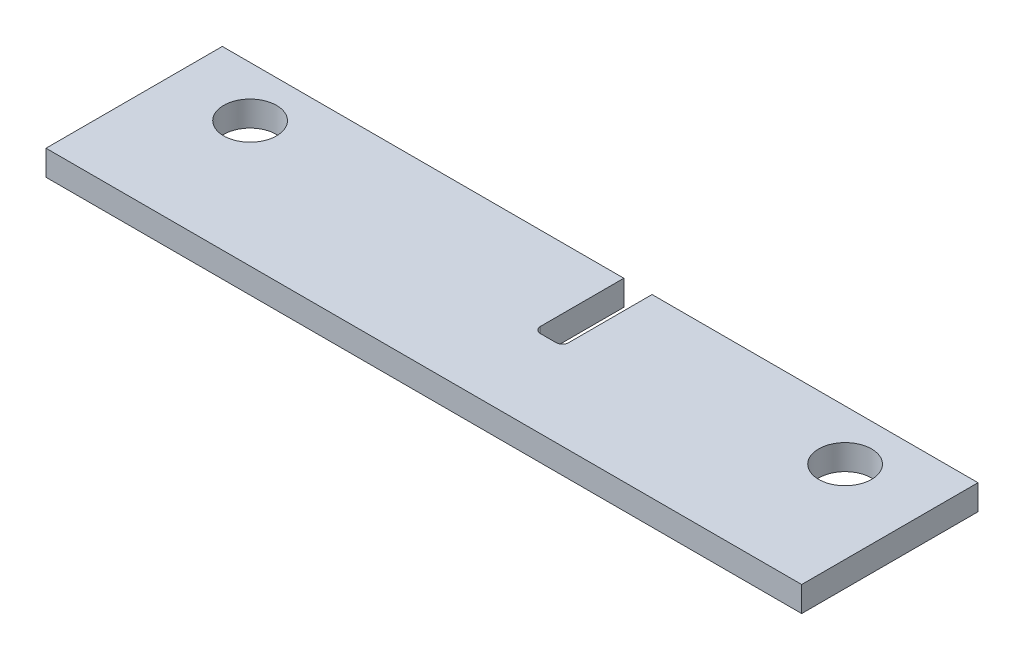
ISO-10303-21;
HEADER;
FILE_DESCRIPTION(('STEP AP214'),'2;1');
FILE_NAME('part.step','',(''),(''),'','','');
FILE_SCHEMA(('AUTOMOTIVE_DESIGN { 1 0 10303 214 1 1 1 1 }'));
ENDSEC;
DATA;
#1=APPLICATION_CONTEXT('core data for automotive mechanical design processes');
#2=APPLICATION_PROTOCOL_DEFINITION('international standard','automotive_design',2000,#1);
#3=PRODUCT_CONTEXT('',#1,'mechanical');
#4=PRODUCT('Part','Part','',(#3));
#5=PRODUCT_RELATED_PRODUCT_CATEGORY('part','',(#4));
#6=PRODUCT_DEFINITION_FORMATION('','',#4);
#7=PRODUCT_DEFINITION_CONTEXT('part definition',#1,'design');
#8=PRODUCT_DEFINITION('design','',#6,#7);
#9=PRODUCT_DEFINITION_SHAPE('','',#8);
#10=(LENGTH_UNIT() NAMED_UNIT(*) SI_UNIT(.MILLI.,.METRE.));
#11=(NAMED_UNIT(*) PLANE_ANGLE_UNIT() SI_UNIT($,.RADIAN.));
#12=(NAMED_UNIT(*) SI_UNIT($,.STERADIAN.) SOLID_ANGLE_UNIT());
#13=UNCERTAINTY_MEASURE_WITH_UNIT(LENGTH_MEASURE(1.E-05),#10,'distance_accuracy_value','');
#14=(GEOMETRIC_REPRESENTATION_CONTEXT(3) GLOBAL_UNCERTAINTY_ASSIGNED_CONTEXT((#13)) GLOBAL_UNIT_ASSIGNED_CONTEXT((#10,
#11,#12)) REPRESENTATION_CONTEXT('',''));
#15=CARTESIAN_POINT('',(0.,0.,0.));
#16=DIRECTION('',(0.,0.,1.));
#17=DIRECTION('',(1.,0.,0.));
#18=AXIS2_PLACEMENT_3D('',#15,#16,#17);
#19=CARTESIAN_POINT('',(0.,0.,249.6));
#20=DIRECTION('',(0.,0.,1.));
#21=DIRECTION('',(1.,0.,0.));
#22=AXIS2_PLACEMENT_3D('',#19,#20,#21);
#23=PLANE('',#22);
#24=DIRECTION('',(-1.,0.,0.));
#25=VECTOR('',#24,1.);
#26=CARTESIAN_POINT('',(2260.6,65.,249.6));
#27=LINE('',#26,#25);
#28=CARTESIAN_POINT('',(2463.038,65.,249.6));
#29=VERTEX_POINT('',#28);
#30=CARTESIAN_POINT('',(2260.6,65.,249.6));
#31=VERTEX_POINT('',#30);
#32=EDGE_CURVE('E119',#29,#31,#27,.T.);
#33=ORIENTED_EDGE('',*,*,#32,.F.);
#34=DIRECTION('',(0.,1.,0.));
#35=VECTOR('',#34,1.);
#36=CARTESIAN_POINT('',(2463.038,52.3,249.6));
#37=LINE('',#36,#35);
#38=CARTESIAN_POINT('',(2463.038,52.3,249.6));
#39=VERTEX_POINT('',#38);
#40=EDGE_CURVE('E186',#39,#29,#37,.T.);
#41=ORIENTED_EDGE('',*,*,#40,.F.);
#42=DIRECTION('',(1.,0.,0.));
#43=VECTOR('',#42,1.);
#44=CARTESIAN_POINT('',(2260.6,52.3,249.6));
#45=LINE('',#44,#43);
#46=CARTESIAN_POINT('',(2260.6,52.3,249.6));
#47=VERTEX_POINT('',#46);
#48=EDGE_CURVE('E144',#47,#39,#45,.T.);
#49=ORIENTED_EDGE('',*,*,#48,.F.);
#50=DIRECTION('',(0.,-1.,0.));
#51=VECTOR('',#50,1.);
#52=CARTESIAN_POINT('',(2260.6,65.,249.6));
#53=LINE('',#52,#51);
#54=EDGE_CURVE('E137',#31,#47,#53,.T.);
#55=ORIENTED_EDGE('',*,*,#54,.F.);
#56=EDGE_LOOP('',(#33,#41,#49,#55));
#57=FACE_BOUND('',#56,.T.);
#58=ADVANCED_FACE('F44',(#57),#23,.F.);
#59=CARTESIAN_POINT('',(2260.6,65.,249.6));
#60=DIRECTION('',(-1.,0.,0.));
#61=DIRECTION('',(0.,0.,1.));
#62=AXIS2_PLACEMENT_3D('',#59,#60,#61);
#63=PLANE('',#62);
#64=DIRECTION('',(0.,0.,1.));
#65=VECTOR('',#64,1.);
#66=CARTESIAN_POINT('',(2260.6,52.3,249.6));
#67=LINE('',#66,#65);
#68=CARTESIAN_POINT('',(2260.6,52.3,338.5));
#69=VERTEX_POINT('',#68);
#70=EDGE_CURVE('E147',#47,#69,#67,.T.);
#71=ORIENTED_EDGE('',*,*,#70,.T.);
#72=DIRECTION('',(0.,-1.,0.));
#73=VECTOR('',#72,1.);
#74=CARTESIAN_POINT('',(2260.6,65.,338.5));
#75=LINE('',#74,#73);
#76=CARTESIAN_POINT('',(2260.6,65.,338.5));
#77=VERTEX_POINT('',#76);
#78=EDGE_CURVE('E139',#77,#69,#75,.T.);
#79=ORIENTED_EDGE('',*,*,#78,.F.);
#80=DIRECTION('',(0.,0.,1.));
#81=VECTOR('',#80,1.);
#82=CARTESIAN_POINT('',(2260.6,65.,249.6));
#83=LINE('',#82,#81);
#84=EDGE_CURVE('E123',#31,#77,#83,.T.);
#85=ORIENTED_EDGE('',*,*,#84,.F.);
#86=ORIENTED_EDGE('',*,*,#54,.T.);
#87=EDGE_LOOP('',(#71,#79,#85,#86));
#88=FACE_BOUND('',#87,.T.);
#89=ADVANCED_FACE('F136',(#88),#63,.T.);
#90=CARTESIAN_POINT('',(2260.6,65.,249.6));
#91=DIRECTION('',(0.,1.,0.));
#92=DIRECTION('',(0.,0.,1.));
#93=AXIS2_PLACEMENT_3D('',#90,#91,#92);
#94=PLANE('',#93);
#95=CARTESIAN_POINT('',(2599.99999999996,65.,275.));
#96=DIRECTION('',(0.,1.,0.));
#97=DIRECTION('',(0.,0.,1.));
#98=AXIS2_PLACEMENT_3D('',#95,#96,#97);
#99=CIRCLE('',#98,13.3349999999999);
#100=CARTESIAN_POINT('',(2599.99999999996,64.9999999999999,261.665));
#101=VERTEX_POINT('',#100);
#102=EDGE_CURVE('E146',#101,#101,#99,.F.);
#103=ORIENTED_EDGE('',*,*,#102,.T.);
#104=EDGE_LOOP('',(#103));
#105=FACE_BOUND('',#104,.T.);
#106=CARTESIAN_POINT('',(2299.99999999996,65.,275.));
#107=DIRECTION('',(0.,1.,0.));
#108=DIRECTION('',(0.,0.,1.));
#109=AXIS2_PLACEMENT_3D('',#106,#107,#108);
#110=CIRCLE('',#109,13.3349999999999);
#111=CARTESIAN_POINT('',(2299.99999999996,65.,261.665));
#112=VERTEX_POINT('',#111);
#113=EDGE_CURVE('E130',#112,#112,#110,.F.);
#114=ORIENTED_EDGE('',*,*,#113,.T.);
#115=EDGE_LOOP('',(#114));
#116=FACE_BOUND('',#115,.T.);
#117=DIRECTION('',(0.,0.,1.));
#118=VECTOR('',#117,1.);
#119=CARTESIAN_POINT('',(2463.038,65.,249.6));
#120=LINE('',#119,#118);
#121=CARTESIAN_POINT('',(2463.038,65.,291.637));
#122=VERTEX_POINT('',#121);
#123=EDGE_CURVE('E125',#29,#122,#120,.T.);
#124=ORIENTED_EDGE('',*,*,#123,.F.);
#125=ORIENTED_EDGE('',*,*,#32,.T.);
#126=ORIENTED_EDGE('',*,*,#84,.T.);
#127=DIRECTION('',(-1.,0.,0.));
#128=VECTOR('',#127,1.);
#129=CARTESIAN_POINT('',(2260.6,65.,338.5));
#130=LINE('',#129,#128);
#131=CARTESIAN_POINT('',(2641.6,65.,338.5));
#132=VERTEX_POINT('',#131);
#133=EDGE_CURVE('E157',#132,#77,#130,.T.);
#134=ORIENTED_EDGE('',*,*,#133,.F.);
#135=DIRECTION('',(0.,0.,1.));
#136=VECTOR('',#135,1.);
#137=CARTESIAN_POINT('',(2641.6,65.,249.6));
#138=LINE('',#137,#136);
#139=CARTESIAN_POINT('',(2641.6,65.,249.6));
#140=VERTEX_POINT('',#139);
#141=EDGE_CURVE('E236',#140,#132,#138,.T.);
#142=ORIENTED_EDGE('',*,*,#141,.F.);
#143=CARTESIAN_POINT('',(2477.262,65.,249.6));
#144=VERTEX_POINT('',#143);
#145=EDGE_CURVE('E132',#140,#144,#27,.T.);
#146=ORIENTED_EDGE('',*,*,#145,.T.);
#147=DIRECTION('',(0.,0.,-1.));
#148=VECTOR('',#147,1.);
#149=CARTESIAN_POINT('',(2477.262,65.,249.6));
#150=LINE('',#149,#148);
#151=CARTESIAN_POINT('',(2477.262,65.,291.637));
#152=VERTEX_POINT('',#151);
#153=EDGE_CURVE('E189',#152,#144,#150,.T.);
#154=ORIENTED_EDGE('',*,*,#153,.F.);
#155=CARTESIAN_POINT('',(2474.087,65.,291.637));
#156=DIRECTION('',(0.,1.,0.));
#157=DIRECTION('',(0.,0.,1.));
#158=AXIS2_PLACEMENT_3D('',#155,#156,#157);
#159=CIRCLE('',#158,3.175);
#160=CARTESIAN_POINT('',(2474.087,65.,294.812));
#161=VERTEX_POINT('',#160);
#162=EDGE_CURVE('E222',#152,#161,#159,.F.);
#163=ORIENTED_EDGE('',*,*,#162,.T.);
#164=DIRECTION('',(1.,0.,0.));
#165=VECTOR('',#164,1.);
#166=CARTESIAN_POINT('',(2260.6,65.,294.812));
#167=LINE('',#166,#165);
#168=CARTESIAN_POINT('',(2466.213,65.,294.812));
#169=VERTEX_POINT('',#168);
#170=EDGE_CURVE('E205',#169,#161,#167,.T.);
#171=ORIENTED_EDGE('',*,*,#170,.F.);
#172=CARTESIAN_POINT('',(2466.213,65.,291.637));
#173=DIRECTION('',(0.,1.,0.));
#174=DIRECTION('',(0.,0.,1.));
#175=AXIS2_PLACEMENT_3D('',#172,#173,#174);
#176=CIRCLE('',#175,3.175);
#177=EDGE_CURVE('E53',#169,#122,#176,.F.);
#178=ORIENTED_EDGE('',*,*,#177,.T.);
#179=EDGE_LOOP('',(#124,#125,#126,#134,#142,#146,#154,#163,#171,#178));
#180=FACE_BOUND('',#179,.T.);
#181=ADVANCED_FACE('F121',(#105,#116,#180),#94,.T.);
#182=CARTESIAN_POINT('',(2641.6,65.,249.6));
#183=DIRECTION('',(1.,0.,0.));
#184=DIRECTION('',(0.,0.,-1.));
#185=AXIS2_PLACEMENT_3D('',#182,#183,#184);
#186=PLANE('',#185);
#187=ORIENTED_EDGE('',*,*,#141,.T.);
#188=DIRECTION('',(0.,1.,0.));
#189=VECTOR('',#188,1.);
#190=CARTESIAN_POINT('',(2641.6,65.,338.5));
#191=LINE('',#190,#189);
#192=CARTESIAN_POINT('',(2641.6,52.3,338.5));
#193=VERTEX_POINT('',#192);
#194=EDGE_CURVE('E160',#193,#132,#191,.T.);
#195=ORIENTED_EDGE('',*,*,#194,.F.);
#196=DIRECTION('',(0.,0.,1.));
#197=VECTOR('',#196,1.);
#198=CARTESIAN_POINT('',(2641.6,52.3,249.6));
#199=LINE('',#198,#197);
#200=CARTESIAN_POINT('',(2641.6,52.3,249.6));
#201=VERTEX_POINT('',#200);
#202=EDGE_CURVE('E230',#201,#193,#199,.T.);
#203=ORIENTED_EDGE('',*,*,#202,.F.);
#204=DIRECTION('',(0.,1.,0.));
#205=VECTOR('',#204,1.);
#206=CARTESIAN_POINT('',(2641.6,65.,249.6));
#207=LINE('',#206,#205);
#208=EDGE_CURVE('E176',#201,#140,#207,.T.);
#209=ORIENTED_EDGE('',*,*,#208,.T.);
#210=EDGE_LOOP('',(#187,#195,#203,#209));
#211=FACE_BOUND('',#210,.T.);
#212=ADVANCED_FACE('F287',(#211),#186,.T.);
#213=CARTESIAN_POINT('',(2260.6,52.3,249.6));
#214=DIRECTION('',(0.,-1.,0.));
#215=DIRECTION('',(0.,0.,-1.));
#216=AXIS2_PLACEMENT_3D('',#213,#214,#215);
#217=PLANE('',#216);
#218=CARTESIAN_POINT('',(2599.99999999996,52.3,275.));
#219=DIRECTION('',(0.,-1.,0.));
#220=DIRECTION('',(0.,0.,-1.));
#221=AXIS2_PLACEMENT_3D('',#218,#219,#220);
#222=CIRCLE('',#221,13.3349999999999);
#223=CARTESIAN_POINT('',(2599.99999999996,52.3,261.665));
#224=VERTEX_POINT('',#223);
#225=EDGE_CURVE('E171',#224,#224,#222,.F.);
#226=ORIENTED_EDGE('',*,*,#225,.T.);
#227=EDGE_LOOP('',(#226));
#228=FACE_BOUND('',#227,.T.);
#229=CARTESIAN_POINT('',(2299.99999999996,52.3,275.));
#230=DIRECTION('',(0.,-1.,0.));
#231=DIRECTION('',(0.,0.,-1.));
#232=AXIS2_PLACEMENT_3D('',#229,#230,#231);
#233=CIRCLE('',#232,13.3349999999999);
#234=CARTESIAN_POINT('',(2299.99999999996,52.3,261.665));
#235=VERTEX_POINT('',#234);
#236=EDGE_CURVE('E175',#235,#235,#233,.F.);
#237=ORIENTED_EDGE('',*,*,#236,.T.);
#238=EDGE_LOOP('',(#237));
#239=FACE_BOUND('',#238,.T.);
#240=DIRECTION('',(0.,0.,1.));
#241=VECTOR('',#240,1.);
#242=CARTESIAN_POINT('',(2463.038,52.3,249.6));
#243=LINE('',#242,#241);
#244=CARTESIAN_POINT('',(2463.038,52.3,291.637));
#245=VERTEX_POINT('',#244);
#246=EDGE_CURVE('E183',#39,#245,#243,.T.);
#247=ORIENTED_EDGE('',*,*,#246,.T.);
#248=CARTESIAN_POINT('',(2466.213,52.3,291.637));
#249=DIRECTION('',(0.,-1.,0.));
#250=DIRECTION('',(0.,0.,-1.));
#251=AXIS2_PLACEMENT_3D('',#248,#249,#250);
#252=CIRCLE('',#251,3.175);
#253=CARTESIAN_POINT('',(2466.213,52.3,294.812));
#254=VERTEX_POINT('',#253);
#255=EDGE_CURVE('E12',#245,#254,#252,.F.);
#256=ORIENTED_EDGE('',*,*,#255,.T.);
#257=DIRECTION('',(1.,0.,0.));
#258=VECTOR('',#257,1.);
#259=CARTESIAN_POINT('',(2463.8,52.3,294.812));
#260=LINE('',#259,#258);
#261=CARTESIAN_POINT('',(2474.087,52.3,294.812));
#262=VERTEX_POINT('',#261);
#263=EDGE_CURVE('E192',#254,#262,#260,.T.);
#264=ORIENTED_EDGE('',*,*,#263,.T.);
#265=CARTESIAN_POINT('',(2474.087,52.3,291.637));
#266=DIRECTION('',(0.,-1.,0.));
#267=DIRECTION('',(0.,0.,-1.));
#268=AXIS2_PLACEMENT_3D('',#265,#266,#267);
#269=CIRCLE('',#268,3.175);
#270=CARTESIAN_POINT('',(2477.262,52.3,291.637));
#271=VERTEX_POINT('',#270);
#272=EDGE_CURVE('E225',#262,#271,#269,.F.);
#273=ORIENTED_EDGE('',*,*,#272,.T.);
#274=DIRECTION('',(0.,0.,-1.));
#275=VECTOR('',#274,1.);
#276=CARTESIAN_POINT('',(2477.262,52.3,249.6));
#277=LINE('',#276,#275);
#278=CARTESIAN_POINT('',(2477.262,52.3,249.6));
#279=VERTEX_POINT('',#278);
#280=EDGE_CURVE('E196',#271,#279,#277,.T.);
#281=ORIENTED_EDGE('',*,*,#280,.T.);
#282=EDGE_CURVE('E199',#279,#201,#45,.T.);
#283=ORIENTED_EDGE('',*,*,#282,.T.);
#284=ORIENTED_EDGE('',*,*,#202,.T.);
#285=DIRECTION('',(1.,0.,0.));
#286=VECTOR('',#285,1.);
#287=CARTESIAN_POINT('',(2260.6,52.3,338.5));
#288=LINE('',#287,#286);
#289=EDGE_CURVE('E164',#69,#193,#288,.T.);
#290=ORIENTED_EDGE('',*,*,#289,.F.);
#291=ORIENTED_EDGE('',*,*,#70,.F.);
#292=ORIENTED_EDGE('',*,*,#48,.T.);
#293=EDGE_LOOP('',(#247,#256,#264,#273,#281,#283,#284,#290,#291,#292));
#294=FACE_BOUND('',#293,.T.);
#295=ADVANCED_FACE('F262',(#228,#239,#294),#217,.T.);
#296=ORIENTED_EDGE('',*,*,#282,.F.);
#297=DIRECTION('',(0.,1.,0.));
#298=VECTOR('',#297,1.);
#299=CARTESIAN_POINT('',(2477.262,0.,249.6));
#300=LINE('',#299,#298);
#301=EDGE_CURVE('E169',#279,#144,#300,.T.);
#302=ORIENTED_EDGE('',*,*,#301,.T.);
#303=ORIENTED_EDGE('',*,*,#145,.F.);
#304=ORIENTED_EDGE('',*,*,#208,.F.);
#305=EDGE_LOOP('',(#296,#302,#303,#304));
#306=FACE_BOUND('',#305,.T.);
#307=ADVANCED_FACE('F245',(#306),#23,.F.);
#308=CARTESIAN_POINT('',(0.,0.,338.5));
#309=DIRECTION('',(0.,0.,1.));
#310=DIRECTION('',(1.,0.,0.));
#311=AXIS2_PLACEMENT_3D('',#308,#309,#310);
#312=PLANE('',#311);
#313=ORIENTED_EDGE('',*,*,#78,.T.);
#314=ORIENTED_EDGE('',*,*,#289,.T.);
#315=ORIENTED_EDGE('',*,*,#194,.T.);
#316=ORIENTED_EDGE('',*,*,#133,.T.);
#317=EDGE_LOOP('',(#313,#314,#315,#316));
#318=FACE_BOUND('',#317,.T.);
#319=ADVANCED_FACE('F265',(#318),#312,.T.);
#320=CARTESIAN_POINT('',(2463.038,52.3,249.6));
#321=DIRECTION('',(-1.,0.,0.));
#322=DIRECTION('',(0.,0.,1.));
#323=AXIS2_PLACEMENT_3D('',#320,#321,#322);
#324=PLANE('',#323);
#325=ORIENTED_EDGE('',*,*,#123,.T.);
#326=DIRECTION('',(0.,1.,0.));
#327=VECTOR('',#326,1.);
#328=CARTESIAN_POINT('',(2463.038,52.3,291.637));
#329=LINE('',#328,#327);
#330=EDGE_CURVE('E60',#122,#245,#329,.F.);
#331=ORIENTED_EDGE('',*,*,#330,.T.);
#332=ORIENTED_EDGE('',*,*,#246,.F.);
#333=ORIENTED_EDGE('',*,*,#40,.T.);
#334=EDGE_LOOP('',(#325,#331,#332,#333));
#335=FACE_BOUND('',#334,.T.);
#336=ADVANCED_FACE('F263',(#335),#324,.F.);
#337=CARTESIAN_POINT('',(2477.262,52.3,249.6));
#338=DIRECTION('',(1.,0.,0.));
#339=DIRECTION('',(0.,0.,-1.));
#340=AXIS2_PLACEMENT_3D('',#337,#338,#339);
#341=PLANE('',#340);
#342=ORIENTED_EDGE('',*,*,#280,.F.);
#343=DIRECTION('',(0.,1.,0.));
#344=VECTOR('',#343,1.);
#345=CARTESIAN_POINT('',(2477.262,65.,291.637));
#346=LINE('',#345,#344);
#347=EDGE_CURVE('E209',#271,#152,#346,.T.);
#348=ORIENTED_EDGE('',*,*,#347,.T.);
#349=ORIENTED_EDGE('',*,*,#153,.T.);
#350=ORIENTED_EDGE('',*,*,#301,.F.);
#351=EDGE_LOOP('',(#342,#348,#349,#350));
#352=FACE_BOUND('',#351,.T.);
#353=ADVANCED_FACE('F249',(#352),#341,.F.);
#354=CARTESIAN_POINT('',(2463.8,52.3,294.812));
#355=DIRECTION('',(0.,0.,1.));
#356=DIRECTION('',(1.,0.,0.));
#357=AXIS2_PLACEMENT_3D('',#354,#355,#356);
#358=PLANE('',#357);
#359=ORIENTED_EDGE('',*,*,#170,.T.);
#360=DIRECTION('',(0.,1.,0.));
#361=VECTOR('',#360,1.);
#362=CARTESIAN_POINT('',(2474.087,52.3,294.812));
#363=LINE('',#362,#361);
#364=EDGE_CURVE('E217',#161,#262,#363,.F.);
#365=ORIENTED_EDGE('',*,*,#364,.T.);
#366=ORIENTED_EDGE('',*,*,#263,.F.);
#367=DIRECTION('',(0.,1.,0.));
#368=VECTOR('',#367,1.);
#369=CARTESIAN_POINT('',(2466.213,65.,294.812));
#370=LINE('',#369,#368);
#371=EDGE_CURVE('E213',#254,#169,#370,.T.);
#372=ORIENTED_EDGE('',*,*,#371,.T.);
#373=EDGE_LOOP('',(#359,#365,#366,#372));
#374=FACE_BOUND('',#373,.T.);
#375=ADVANCED_FACE('F256',(#374),#358,.F.);
#376=CARTESIAN_POINT('',(2299.99999999996,181.249999999996,275.));
#377=DIRECTION('',(0.,-1.,0.));
#378=DIRECTION('',(0.,0.,-1.));
#379=AXIS2_PLACEMENT_3D('',#376,#377,#378);
#380=CYLINDRICAL_SURFACE('',#379,13.3349999999999);
#381=CARTESIAN_POINT('',(2299.99999999996,65.,261.665));
#382=CARTESIAN_POINT('',(2299.99999999996,64.8677083333333,261.665));
#383=CARTESIAN_POINT('',(2299.99999999996,64.7354166666666,261.665));
#384=CARTESIAN_POINT('',(2299.99999999996,64.4708333333333,261.665));
#385=CARTESIAN_POINT('',(2299.99999999996,64.3385416666666,261.665));
#386=CARTESIAN_POINT('',(2299.99999999996,64.0739583333333,261.665));
#387=CARTESIAN_POINT('',(2299.99999999996,63.9416666666666,261.665));
#388=CARTESIAN_POINT('',(2299.99999999996,63.6770833333333,261.665));
#389=CARTESIAN_POINT('',(2299.99999999996,63.5447916666666,261.665));
#390=CARTESIAN_POINT('',(2299.99999999996,63.2802083333333,261.665));
#391=CARTESIAN_POINT('',(2299.99999999996,63.1479166666666,261.665));
#392=CARTESIAN_POINT('',(2299.99999999996,62.8833333333333,261.665));
#393=CARTESIAN_POINT('',(2299.99999999996,62.7510416666666,261.665));
#394=CARTESIAN_POINT('',(2299.99999999996,62.4864583333333,261.665));
#395=CARTESIAN_POINT('',(2299.99999999996,62.3541666666666,261.665));
#396=CARTESIAN_POINT('',(2299.99999999996,62.0895833333333,261.665));
#397=CARTESIAN_POINT('',(2299.99999999996,61.9572916666666,261.665));
#398=CARTESIAN_POINT('',(2299.99999999996,61.6927083333333,261.665));
#399=CARTESIAN_POINT('',(2299.99999999996,61.5604166666666,261.665));
#400=CARTESIAN_POINT('',(2299.99999999996,61.2958333333333,261.665));
#401=CARTESIAN_POINT('',(2299.99999999996,61.1635416666666,261.665));
#402=CARTESIAN_POINT('',(2299.99999999996,60.8989583333333,261.665));
#403=CARTESIAN_POINT('',(2299.99999999996,60.7666666666666,261.665));
#404=CARTESIAN_POINT('',(2299.99999999996,60.5020833333333,261.665));
#405=CARTESIAN_POINT('',(2299.99999999996,60.3697916666666,261.665));
#406=CARTESIAN_POINT('',(2299.99999999996,60.1052083333333,261.665));
#407=CARTESIAN_POINT('',(2299.99999999996,59.9729166666666,261.665));
#408=CARTESIAN_POINT('',(2299.99999999996,59.7083333333333,261.665));
#409=CARTESIAN_POINT('',(2299.99999999996,59.5760416666666,261.665));
#410=CARTESIAN_POINT('',(2299.99999999996,59.3114583333333,261.665));
#411=CARTESIAN_POINT('',(2299.99999999996,59.1791666666666,261.665));
#412=CARTESIAN_POINT('',(2299.99999999996,58.9145833333333,261.665));
#413=CARTESIAN_POINT('',(2299.99999999996,58.7822916666666,261.665));
#414=CARTESIAN_POINT('',(2299.99999999996,58.5177083333333,261.665));
#415=CARTESIAN_POINT('',(2299.99999999996,58.3854166666666,261.665));
#416=CARTESIAN_POINT('',(2299.99999999996,58.1208333333333,261.665));
#417=CARTESIAN_POINT('',(2299.99999999996,57.9885416666666,261.665));
#418=CARTESIAN_POINT('',(2299.99999999996,57.7239583333333,261.665));
#419=CARTESIAN_POINT('',(2299.99999999996,57.5916666666666,261.665));
#420=CARTESIAN_POINT('',(2299.99999999996,57.3270833333333,261.665));
#421=CARTESIAN_POINT('',(2299.99999999996,57.1947916666666,261.665));
#422=CARTESIAN_POINT('',(2299.99999999996,56.9302083333333,261.665));
#423=CARTESIAN_POINT('',(2299.99999999996,56.7979166666666,261.665));
#424=CARTESIAN_POINT('',(2299.99999999996,56.5333333333333,261.665));
#425=CARTESIAN_POINT('',(2299.99999999996,56.4010416666666,261.665));
#426=CARTESIAN_POINT('',(2299.99999999996,56.1364583333333,261.665));
#427=CARTESIAN_POINT('',(2299.99999999996,56.0041666666666,261.665));
#428=CARTESIAN_POINT('',(2299.99999999996,55.7395833333333,261.665));
#429=CARTESIAN_POINT('',(2299.99999999996,55.6072916666666,261.665));
#430=CARTESIAN_POINT('',(2299.99999999996,55.3427083333333,261.665));
#431=CARTESIAN_POINT('',(2299.99999999996,55.2104166666666,261.665));
#432=CARTESIAN_POINT('',(2299.99999999996,54.9458333333333,261.665));
#433=CARTESIAN_POINT('',(2299.99999999996,54.8135416666666,261.665));
#434=CARTESIAN_POINT('',(2299.99999999996,54.5489583333333,261.665));
#435=CARTESIAN_POINT('',(2299.99999999996,54.4166666666666,261.665));
#436=CARTESIAN_POINT('',(2299.99999999996,54.1520833333333,261.665));
#437=CARTESIAN_POINT('',(2299.99999999996,54.0197916666666,261.665));
#438=CARTESIAN_POINT('',(2299.99999999996,53.7552083333333,261.665));
#439=CARTESIAN_POINT('',(2299.99999999996,53.6229166666666,261.665));
#440=CARTESIAN_POINT('',(2299.99999999996,53.3583333333333,261.665));
#441=CARTESIAN_POINT('',(2299.99999999996,53.2260416666666,261.665));
#442=CARTESIAN_POINT('',(2299.99999999996,52.9614583333333,261.665));
#443=CARTESIAN_POINT('',(2299.99999999996,52.8291666666666,261.665));
#444=CARTESIAN_POINT('',(2299.99999999996,52.5645833333333,261.665));
#445=CARTESIAN_POINT('',(2299.99999999996,52.4322916666666,261.665));
#446=CARTESIAN_POINT('',(2299.99999999996,52.3,261.665));
#447=B_SPLINE_CURVE_WITH_KNOTS('',3,(#381,#382,#383,#384,#385,#386,#387,#388,#389,#390,#391,
#392,#393,#394,#395,#396,#397,#398,#399,#400,#401,#402,#403,#404,#405,#406,#407,#408,#409,#410,
#411,#412,#413,#414,#415,#416,#417,#418,#419,#420,#421,#422,#423,#424,#425,#426,#427,#428,#429,
#430,#431,#432,#433,#434,#435,#436,#437,#438,#439,#440,#441,#442,#443,#444,#445,#446),
.UNSPECIFIED.,.F.,.F.,(4,2,2,2,2,2,2,2,2,2,2,2,2,2,2,2,2,2,2,2,2,2,2,2,2,2,2,2,2,2,2,2,4),(0.,
0.396875000000005,0.793749999999996,1.190625,1.58750000000001,1.984375,2.38125,2.77812500000001,
3.17500000000001,3.571875,3.96875000000001,4.36562500000001,4.7625,5.15937500000001,
5.55625000000001,5.953125,6.35000000000001,6.74687500000001,7.14375,7.54062500000001,
7.93750000000001,8.334375,8.73125000000001,9.12812500000001,9.52500000000001,9.92187500000002,
10.31875,10.715625,11.1125,11.509375,11.90625,12.303125,12.7),.UNSPECIFIED.);
#448=EDGE_CURVE('BSEAM301',#112,#235,#447,.T.);
#449=ORIENTED_EDGE('',*,*,#113,.F.);
#450=ORIENTED_EDGE('',*,*,#236,.F.);
#451=ORIENTED_EDGE('',*,*,#448,.T.);
#452=ORIENTED_EDGE('',*,*,#448,.F.);
#453=EDGE_LOOP('',(#449,#451,#450,#452));
#454=FACE_BOUND('',#453,.T.);
#455=ADVANCED_FACE('F301',(#454),#380,.F.);
#456=CARTESIAN_POINT('',(2599.99999999996,289.999999999996,275.));
#457=DIRECTION('',(0.,-1.,0.));
#458=DIRECTION('',(0.,0.,-1.));
#459=AXIS2_PLACEMENT_3D('',#456,#457,#458);
#460=CYLINDRICAL_SURFACE('',#459,13.3349999999999);
#461=CARTESIAN_POINT('',(2599.99999999996,64.9999999999999,261.665));
#462=CARTESIAN_POINT('',(2599.99999999996,64.8677083333333,261.665));
#463=CARTESIAN_POINT('',(2599.99999999996,64.7354166666666,261.665));
#464=CARTESIAN_POINT('',(2599.99999999996,64.4708333333333,261.665));
#465=CARTESIAN_POINT('',(2599.99999999996,64.3385416666666,261.665));
#466=CARTESIAN_POINT('',(2599.99999999996,64.0739583333333,261.665));
#467=CARTESIAN_POINT('',(2599.99999999996,63.9416666666666,261.665));
#468=CARTESIAN_POINT('',(2599.99999999996,63.6770833333333,261.665));
#469=CARTESIAN_POINT('',(2599.99999999996,63.5447916666666,261.665));
#470=CARTESIAN_POINT('',(2599.99999999996,63.2802083333333,261.665));
#471=CARTESIAN_POINT('',(2599.99999999996,63.1479166666666,261.665));
#472=CARTESIAN_POINT('',(2599.99999999996,62.8833333333333,261.665));
#473=CARTESIAN_POINT('',(2599.99999999996,62.7510416666666,261.665));
#474=CARTESIAN_POINT('',(2599.99999999996,62.4864583333333,261.665));
#475=CARTESIAN_POINT('',(2599.99999999996,62.3541666666666,261.665));
#476=CARTESIAN_POINT('',(2599.99999999996,62.0895833333333,261.665));
#477=CARTESIAN_POINT('',(2599.99999999996,61.9572916666666,261.665));
#478=CARTESIAN_POINT('',(2599.99999999996,61.6927083333333,261.665));
#479=CARTESIAN_POINT('',(2599.99999999996,61.5604166666666,261.665));
#480=CARTESIAN_POINT('',(2599.99999999996,61.2958333333333,261.665));
#481=CARTESIAN_POINT('',(2599.99999999996,61.1635416666666,261.665));
#482=CARTESIAN_POINT('',(2599.99999999996,60.8989583333333,261.665));
#483=CARTESIAN_POINT('',(2599.99999999996,60.7666666666666,261.665));
#484=CARTESIAN_POINT('',(2599.99999999996,60.5020833333333,261.665));
#485=CARTESIAN_POINT('',(2599.99999999996,60.3697916666666,261.665));
#486=CARTESIAN_POINT('',(2599.99999999996,60.1052083333333,261.665));
#487=CARTESIAN_POINT('',(2599.99999999996,59.9729166666666,261.665));
#488=CARTESIAN_POINT('',(2599.99999999996,59.7083333333333,261.665));
#489=CARTESIAN_POINT('',(2599.99999999996,59.5760416666666,261.665));
#490=CARTESIAN_POINT('',(2599.99999999996,59.3114583333333,261.665));
#491=CARTESIAN_POINT('',(2599.99999999996,59.1791666666666,261.665));
#492=CARTESIAN_POINT('',(2599.99999999996,58.9145833333333,261.665));
#493=CARTESIAN_POINT('',(2599.99999999996,58.7822916666666,261.665));
#494=CARTESIAN_POINT('',(2599.99999999996,58.5177083333333,261.665));
#495=CARTESIAN_POINT('',(2599.99999999996,58.3854166666666,261.665));
#496=CARTESIAN_POINT('',(2599.99999999996,58.1208333333333,261.665));
#497=CARTESIAN_POINT('',(2599.99999999996,57.9885416666666,261.665));
#498=CARTESIAN_POINT('',(2599.99999999996,57.7239583333333,261.665));
#499=CARTESIAN_POINT('',(2599.99999999996,57.5916666666666,261.665));
#500=CARTESIAN_POINT('',(2599.99999999996,57.3270833333333,261.665));
#501=CARTESIAN_POINT('',(2599.99999999996,57.1947916666666,261.665));
#502=CARTESIAN_POINT('',(2599.99999999996,56.9302083333333,261.665));
#503=CARTESIAN_POINT('',(2599.99999999996,56.7979166666666,261.665));
#504=CARTESIAN_POINT('',(2599.99999999996,56.5333333333333,261.665));
#505=CARTESIAN_POINT('',(2599.99999999996,56.4010416666666,261.665));
#506=CARTESIAN_POINT('',(2599.99999999996,56.1364583333333,261.665));
#507=CARTESIAN_POINT('',(2599.99999999996,56.0041666666666,261.665));
#508=CARTESIAN_POINT('',(2599.99999999996,55.7395833333333,261.665));
#509=CARTESIAN_POINT('',(2599.99999999996,55.6072916666666,261.665));
#510=CARTESIAN_POINT('',(2599.99999999996,55.3427083333333,261.665));
#511=CARTESIAN_POINT('',(2599.99999999996,55.2104166666666,261.665));
#512=CARTESIAN_POINT('',(2599.99999999996,54.9458333333333,261.665));
#513=CARTESIAN_POINT('',(2599.99999999996,54.8135416666666,261.665));
#514=CARTESIAN_POINT('',(2599.99999999996,54.5489583333333,261.665));
#515=CARTESIAN_POINT('',(2599.99999999996,54.4166666666666,261.665));
#516=CARTESIAN_POINT('',(2599.99999999996,54.1520833333333,261.665));
#517=CARTESIAN_POINT('',(2599.99999999996,54.0197916666666,261.665));
#518=CARTESIAN_POINT('',(2599.99999999996,53.7552083333333,261.665));
#519=CARTESIAN_POINT('',(2599.99999999996,53.6229166666666,261.665));
#520=CARTESIAN_POINT('',(2599.99999999996,53.3583333333333,261.665));
#521=CARTESIAN_POINT('',(2599.99999999996,53.2260416666666,261.665));
#522=CARTESIAN_POINT('',(2599.99999999996,52.9614583333333,261.665));
#523=CARTESIAN_POINT('',(2599.99999999996,52.8291666666666,261.665));
#524=CARTESIAN_POINT('',(2599.99999999996,52.5645833333333,261.665));
#525=CARTESIAN_POINT('',(2599.99999999996,52.4322916666666,261.665));
#526=CARTESIAN_POINT('',(2599.99999999996,52.3,261.665));
#527=B_SPLINE_CURVE_WITH_KNOTS('',3,(#461,#462,#463,#464,#465,#466,#467,#468,#469,#470,#471,
#472,#473,#474,#475,#476,#477,#478,#479,#480,#481,#482,#483,#484,#485,#486,#487,#488,#489,#490,
#491,#492,#493,#494,#495,#496,#497,#498,#499,#500,#501,#502,#503,#504,#505,#506,#507,#508,#509,
#510,#511,#512,#513,#514,#515,#516,#517,#518,#519,#520,#521,#522,#523,#524,#525,#526),
.UNSPECIFIED.,.F.,.F.,(4,2,2,2,2,2,2,2,2,2,2,2,2,2,2,2,2,2,2,2,2,2,2,2,2,2,2,2,2,2,2,2,4),(0.,
0.396874999999991,0.79375000000001,1.190625,1.58749999999999,1.98437500000001,2.38125,
2.77812499999999,3.17499999999998,3.571875,3.96874999999999,4.36562499999998,4.7625,
5.15937499999999,5.55624999999998,5.953125,6.34999999999999,6.74687499999999,7.14375,7.540625,
7.93749999999999,8.334375,8.73125,9.12812499999999,9.52500000000001,9.921875,10.31875,10.715625,
11.1125,11.509375,11.90625,12.303125,12.7),.UNSPECIFIED.);
#528=EDGE_CURVE('BSEAM299',#101,#224,#527,.T.);
#529=ORIENTED_EDGE('',*,*,#102,.F.);
#530=ORIENTED_EDGE('',*,*,#225,.F.);
#531=ORIENTED_EDGE('',*,*,#528,.T.);
#532=ORIENTED_EDGE('',*,*,#528,.F.);
#533=EDGE_LOOP('',(#529,#531,#530,#532));
#534=FACE_BOUND('',#533,.T.);
#535=ADVANCED_FACE('F299',(#534),#460,.F.);
#536=CARTESIAN_POINT('',(2474.087,52.3,291.637));
#537=DIRECTION('',(0.,-1.,0.));
#538=DIRECTION('',(0.,0.,-1.));
#539=AXIS2_PLACEMENT_3D('',#536,#537,#538);
#540=CYLINDRICAL_SURFACE('',#539,3.175);
#541=ORIENTED_EDGE('',*,*,#272,.F.);
#542=ORIENTED_EDGE('',*,*,#364,.F.);
#543=ORIENTED_EDGE('',*,*,#162,.F.);
#544=ORIENTED_EDGE('',*,*,#347,.F.);
#545=EDGE_LOOP('',(#541,#542,#543,#544));
#546=FACE_BOUND('',#545,.T.);
#547=ADVANCED_FACE('F253',(#546),#540,.F.);
#548=CARTESIAN_POINT('',(2466.213,52.3,291.637));
#549=DIRECTION('',(0.,-1.,0.));
#550=DIRECTION('',(0.,0.,-1.));
#551=AXIS2_PLACEMENT_3D('',#548,#549,#550);
#552=CYLINDRICAL_SURFACE('',#551,3.175);
#553=ORIENTED_EDGE('',*,*,#255,.F.);
#554=ORIENTED_EDGE('',*,*,#330,.F.);
#555=ORIENTED_EDGE('',*,*,#177,.F.);
#556=ORIENTED_EDGE('',*,*,#371,.F.);
#557=EDGE_LOOP('',(#553,#554,#555,#556));
#558=FACE_BOUND('',#557,.T.);
#559=ADVANCED_FACE('F46',(#558),#552,.F.);
#560=CLOSED_SHELL('',(#58,#89,#181,#212,#295,#307,#319,#336,#353,#375,#455,#535,#547,#559));
#561=MANIFOLD_SOLID_BREP('B2',#560);
#562=ADVANCED_BREP_SHAPE_REPRESENTATION('',(#18,#561),#14);
#563=SHAPE_DEFINITION_REPRESENTATION(#9,#562);
ENDSEC;
END-ISO-10303-21;
